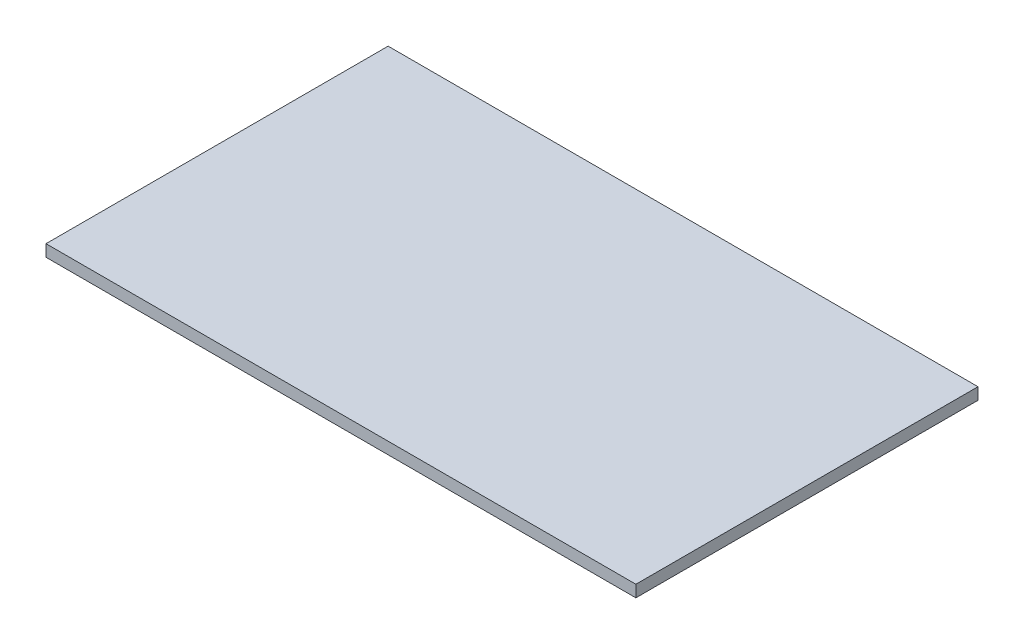
ISO-10303-21;
HEADER;
FILE_DESCRIPTION(('STEP AP214'),'2;1');
FILE_NAME('part.step','',(''),(''),'','','');
FILE_SCHEMA(('AUTOMOTIVE_DESIGN { 1 0 10303 214 1 1 1 1 }'));
ENDSEC;
DATA;
#1=APPLICATION_CONTEXT('core data for automotive mechanical design processes');
#2=APPLICATION_PROTOCOL_DEFINITION('international standard','automotive_design',2000,#1);
#3=PRODUCT_CONTEXT('',#1,'mechanical');
#4=PRODUCT('Part','Part','',(#3));
#5=PRODUCT_RELATED_PRODUCT_CATEGORY('part','',(#4));
#6=PRODUCT_DEFINITION_FORMATION('','',#4);
#7=PRODUCT_DEFINITION_CONTEXT('part definition',#1,'design');
#8=PRODUCT_DEFINITION('design','',#6,#7);
#9=PRODUCT_DEFINITION_SHAPE('','',#8);
#10=(LENGTH_UNIT() NAMED_UNIT(*) SI_UNIT(.MILLI.,.METRE.));
#11=(NAMED_UNIT(*) PLANE_ANGLE_UNIT() SI_UNIT($,.RADIAN.));
#12=(NAMED_UNIT(*) SI_UNIT($,.STERADIAN.) SOLID_ANGLE_UNIT());
#13=UNCERTAINTY_MEASURE_WITH_UNIT(LENGTH_MEASURE(1.E-05),#10,'distance_accuracy_value','');
#14=(GEOMETRIC_REPRESENTATION_CONTEXT(3) GLOBAL_UNCERTAINTY_ASSIGNED_CONTEXT((#13)) GLOBAL_UNIT_ASSIGNED_CONTEXT((#10,
#11,#12)) REPRESENTATION_CONTEXT('',''));
#15=CARTESIAN_POINT('',(0.,0.,0.));
#16=DIRECTION('',(0.,0.,1.));
#17=DIRECTION('',(1.,0.,0.));
#18=AXIS2_PLACEMENT_3D('',#15,#16,#17);
#19=CARTESIAN_POINT('',(250.,10.,145.));
#20=DIRECTION('',(-1.,0.,0.));
#21=DIRECTION('',(0.,0.,1.));
#22=AXIS2_PLACEMENT_3D('',#19,#20,#21);
#23=PLANE('',#22);
#24=DIRECTION('',(0.,0.,-1.));
#25=VECTOR('',#24,1.);
#26=CARTESIAN_POINT('',(250.,0.,145.));
#27=LINE('',#26,#25);
#28=CARTESIAN_POINT('',(250.,0.,145.));
#29=VERTEX_POINT('',#28);
#30=CARTESIAN_POINT('',(250.,0.,-145.));
#31=VERTEX_POINT('',#30);
#32=EDGE_CURVE('E96',#29,#31,#27,.T.);
#33=ORIENTED_EDGE('',*,*,#32,.T.);
#34=DIRECTION('',(0.,-1.,0.));
#35=VECTOR('',#34,1.);
#36=CARTESIAN_POINT('',(250.,10.,-145.));
#37=LINE('',#36,#35);
#38=CARTESIAN_POINT('',(250.,10.,-145.));
#39=VERTEX_POINT('',#38);
#40=EDGE_CURVE('E11',#39,#31,#37,.T.);
#41=ORIENTED_EDGE('',*,*,#40,.F.);
#42=DIRECTION('',(0.,0.,-1.));
#43=VECTOR('',#42,1.);
#44=CARTESIAN_POINT('',(250.,10.,145.));
#45=LINE('',#44,#43);
#46=CARTESIAN_POINT('',(250.,10.,145.));
#47=VERTEX_POINT('',#46);
#48=EDGE_CURVE('E84',#47,#39,#45,.T.);
#49=ORIENTED_EDGE('',*,*,#48,.F.);
#50=DIRECTION('',(0.,-1.,0.));
#51=VECTOR('',#50,1.);
#52=CARTESIAN_POINT('',(250.,10.,145.));
#53=LINE('',#52,#51);
#54=EDGE_CURVE('E92',#47,#29,#53,.T.);
#55=ORIENTED_EDGE('',*,*,#54,.T.);
#56=EDGE_LOOP('',(#33,#41,#49,#55));
#57=FACE_BOUND('',#56,.T.);
#58=ADVANCED_FACE('F33',(#57),#23,.F.);
#59=CARTESIAN_POINT('',(-250.,10.,-145.));
#60=DIRECTION('',(0.,0.,1.));
#61=DIRECTION('',(1.,0.,0.));
#62=AXIS2_PLACEMENT_3D('',#59,#60,#61);
#63=PLANE('',#62);
#64=DIRECTION('',(-1.,0.,0.));
#65=VECTOR('',#64,1.);
#66=CARTESIAN_POINT('',(-250.,0.,-145.));
#67=LINE('',#66,#65);
#68=CARTESIAN_POINT('',(-250.,0.,-145.));
#69=VERTEX_POINT('',#68);
#70=EDGE_CURVE('E88',#31,#69,#67,.T.);
#71=ORIENTED_EDGE('',*,*,#70,.T.);
#72=DIRECTION('',(0.,-1.,0.));
#73=VECTOR('',#72,1.);
#74=CARTESIAN_POINT('',(-250.,10.,-145.));
#75=LINE('',#74,#73);
#76=CARTESIAN_POINT('',(-250.,10.,-145.));
#77=VERTEX_POINT('',#76);
#78=EDGE_CURVE('E41',#77,#69,#75,.T.);
#79=ORIENTED_EDGE('',*,*,#78,.F.);
#80=DIRECTION('',(-1.,0.,0.));
#81=VECTOR('',#80,1.);
#82=CARTESIAN_POINT('',(-250.,10.,-145.));
#83=LINE('',#82,#81);
#84=EDGE_CURVE('E79',#39,#77,#83,.T.);
#85=ORIENTED_EDGE('',*,*,#84,.F.);
#86=ORIENTED_EDGE('',*,*,#40,.T.);
#87=EDGE_LOOP('',(#71,#79,#85,#86));
#88=FACE_BOUND('',#87,.T.);
#89=ADVANCED_FACE('F87',(#88),#63,.F.);
#90=CARTESIAN_POINT('',(-250.,10.,145.));
#91=DIRECTION('',(1.,0.,0.));
#92=DIRECTION('',(0.,0.,-1.));
#93=AXIS2_PLACEMENT_3D('',#90,#91,#92);
#94=PLANE('',#93);
#95=DIRECTION('',(0.,0.,1.));
#96=VECTOR('',#95,1.);
#97=CARTESIAN_POINT('',(-250.,0.,145.));
#98=LINE('',#97,#96);
#99=CARTESIAN_POINT('',(-250.,0.,145.));
#100=VERTEX_POINT('',#99);
#101=EDGE_CURVE('E66',#69,#100,#98,.T.);
#102=ORIENTED_EDGE('',*,*,#101,.T.);
#103=DIRECTION('',(0.,-1.,0.));
#104=VECTOR('',#103,1.);
#105=CARTESIAN_POINT('',(-250.,10.,145.));
#106=LINE('',#105,#104);
#107=CARTESIAN_POINT('',(-250.,10.,145.));
#108=VERTEX_POINT('',#107);
#109=EDGE_CURVE('E89',#108,#100,#106,.T.);
#110=ORIENTED_EDGE('',*,*,#109,.F.);
#111=DIRECTION('',(0.,0.,1.));
#112=VECTOR('',#111,1.);
#113=CARTESIAN_POINT('',(-250.,10.,145.));
#114=LINE('',#113,#112);
#115=EDGE_CURVE('E82',#77,#108,#114,.T.);
#116=ORIENTED_EDGE('',*,*,#115,.F.);
#117=ORIENTED_EDGE('',*,*,#78,.T.);
#118=EDGE_LOOP('',(#102,#110,#116,#117));
#119=FACE_BOUND('',#118,.T.);
#120=ADVANCED_FACE('F90',(#119),#94,.F.);
#121=CARTESIAN_POINT('',(-250.,10.,145.));
#122=DIRECTION('',(0.,0.,-1.));
#123=DIRECTION('',(-1.,0.,0.));
#124=AXIS2_PLACEMENT_3D('',#121,#122,#123);
#125=PLANE('',#124);
#126=DIRECTION('',(1.,0.,0.));
#127=VECTOR('',#126,1.);
#128=CARTESIAN_POINT('',(-250.,0.,145.));
#129=LINE('',#128,#127);
#130=EDGE_CURVE('E72',#100,#29,#129,.T.);
#131=ORIENTED_EDGE('',*,*,#130,.T.);
#132=ORIENTED_EDGE('',*,*,#54,.F.);
#133=DIRECTION('',(1.,0.,0.));
#134=VECTOR('',#133,1.);
#135=CARTESIAN_POINT('',(-250.,10.,145.));
#136=LINE('',#135,#134);
#137=EDGE_CURVE('E49',#108,#47,#136,.T.);
#138=ORIENTED_EDGE('',*,*,#137,.F.);
#139=ORIENTED_EDGE('',*,*,#109,.T.);
#140=EDGE_LOOP('',(#131,#132,#138,#139));
#141=FACE_BOUND('',#140,.T.);
#142=ADVANCED_FACE('F103',(#141),#125,.F.);
#143=CARTESIAN_POINT('',(0.,10.,0.));
#144=DIRECTION('',(0.,-1.,0.));
#145=DIRECTION('',(0.,0.,-1.));
#146=AXIS2_PLACEMENT_3D('',#143,#144,#145);
#147=PLANE('',#146);
#148=ORIENTED_EDGE('',*,*,#48,.T.);
#149=ORIENTED_EDGE('',*,*,#84,.T.);
#150=ORIENTED_EDGE('',*,*,#115,.T.);
#151=ORIENTED_EDGE('',*,*,#137,.T.);
#152=EDGE_LOOP('',(#148,#149,#150,#151));
#153=FACE_BOUND('',#152,.T.);
#154=ADVANCED_FACE('F80',(#153),#147,.F.);
#155=CARTESIAN_POINT('',(0.,0.,0.));
#156=DIRECTION('',(0.,-1.,0.));
#157=DIRECTION('',(0.,0.,-1.));
#158=AXIS2_PLACEMENT_3D('',#155,#156,#157);
#159=PLANE('',#158);
#160=ORIENTED_EDGE('',*,*,#32,.F.);
#161=ORIENTED_EDGE('',*,*,#130,.F.);
#162=ORIENTED_EDGE('',*,*,#101,.F.);
#163=ORIENTED_EDGE('',*,*,#70,.F.);
#164=EDGE_LOOP('',(#160,#161,#162,#163));
#165=FACE_BOUND('',#164,.T.);
#166=ADVANCED_FACE('F106',(#165),#159,.T.);
#167=CLOSED_SHELL('',(#58,#89,#120,#142,#154,#166));
#168=MANIFOLD_SOLID_BREP('B2',#167);
#169=ADVANCED_BREP_SHAPE_REPRESENTATION('',(#18,#168),#14);
#170=SHAPE_DEFINITION_REPRESENTATION(#9,#169);
ENDSEC;
END-ISO-10303-21;
